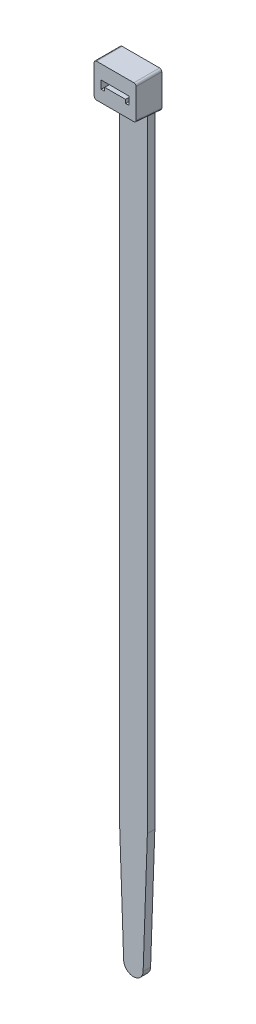
ISO-10303-21;
HEADER;
FILE_DESCRIPTION(('STEP AP214'),'2;1');
FILE_NAME('part.step','',(''),(''),'','','');
FILE_SCHEMA(('AUTOMOTIVE_DESIGN { 1 0 10303 214 1 1 1 1 }'));
ENDSEC;
DATA;
#1=APPLICATION_CONTEXT('core data for automotive mechanical design processes');
#2=APPLICATION_PROTOCOL_DEFINITION('international standard','automotive_design',2000,#1);
#3=PRODUCT_CONTEXT('',#1,'mechanical');
#4=PRODUCT('Part','Part','',(#3));
#5=PRODUCT_RELATED_PRODUCT_CATEGORY('part','',(#4));
#6=PRODUCT_DEFINITION_FORMATION('','',#4);
#7=PRODUCT_DEFINITION_CONTEXT('part definition',#1,'design');
#8=PRODUCT_DEFINITION('design','',#6,#7);
#9=PRODUCT_DEFINITION_SHAPE('','',#8);
#10=(LENGTH_UNIT() NAMED_UNIT(*) SI_UNIT(.MILLI.,.METRE.));
#11=(NAMED_UNIT(*) PLANE_ANGLE_UNIT() SI_UNIT($,.RADIAN.));
#12=(NAMED_UNIT(*) SI_UNIT($,.STERADIAN.) SOLID_ANGLE_UNIT());
#13=UNCERTAINTY_MEASURE_WITH_UNIT(LENGTH_MEASURE(1.E-05),#10,'distance_accuracy_value','');
#14=(GEOMETRIC_REPRESENTATION_CONTEXT(3) GLOBAL_UNCERTAINTY_ASSIGNED_CONTEXT((#13)) GLOBAL_UNIT_ASSIGNED_CONTEXT((#10,
#11,#12)) REPRESENTATION_CONTEXT('',''));
#15=CARTESIAN_POINT('',(0.,0.,0.));
#16=DIRECTION('',(0.,0.,1.));
#17=DIRECTION('',(1.,0.,0.));
#18=AXIS2_PLACEMENT_3D('',#15,#16,#17);
#19=CARTESIAN_POINT('',(0.,-213.244366112343,2.032));
#20=DIRECTION('',(0.,0.,-1.));
#21=DIRECTION('',(-1.,0.,0.));
#22=AXIS2_PLACEMENT_3D('',#19,#20,#21);
#23=CYLINDRICAL_SURFACE('',#22,2.65563388765673);
#24=CARTESIAN_POINT('',(0.,-213.244366112343,0.));
#25=DIRECTION('',(0.,0.,1.));
#26=DIRECTION('',(-1.,0.,0.));
#27=AXIS2_PLACEMENT_3D('',#24,#25,#26);
#28=CIRCLE('',#27,2.65563388765673);
#29=CARTESIAN_POINT('',(-2.65401614724512,-213.337046398449,0.));
#30=VERTEX_POINT('',#29);
#31=CARTESIAN_POINT('',(2.65401614724517,-213.337046398449,0.));
#32=VERTEX_POINT('',#31);
#33=EDGE_CURVE('E322',#30,#32,#28,.T.);
#34=ORIENTED_EDGE('',*,*,#33,.T.);
#35=DIRECTION('',(0.,0.,-1.));
#36=VECTOR('',#35,1.);
#37=CARTESIAN_POINT('',(2.65401614724517,-213.337046398449,2.032));
#38=LINE('',#37,#36);
#39=CARTESIAN_POINT('',(2.65401614724517,-213.337046398449,2.032));
#40=VERTEX_POINT('',#39);
#41=EDGE_CURVE('E341',#40,#32,#38,.T.);
#42=ORIENTED_EDGE('',*,*,#41,.F.);
#43=CARTESIAN_POINT('',(0.,-213.244366112343,2.032));
#44=DIRECTION('',(0.,0.,1.));
#45=DIRECTION('',(-1.,0.,0.));
#46=AXIS2_PLACEMENT_3D('',#43,#44,#45);
#47=CIRCLE('',#46,2.65563388765673);
#48=CARTESIAN_POINT('',(-2.65401614724512,-213.337046398449,2.032));
#49=VERTEX_POINT('',#48);
#50=EDGE_CURVE('E323',#49,#40,#47,.T.);
#51=ORIENTED_EDGE('',*,*,#50,.F.);
#52=DIRECTION('',(0.,0.,-1.));
#53=VECTOR('',#52,1.);
#54=CARTESIAN_POINT('',(-2.65401614724512,-213.337046398449,2.032));
#55=LINE('',#54,#53);
#56=EDGE_CURVE('E253',#49,#30,#55,.T.);
#57=ORIENTED_EDGE('',*,*,#56,.T.);
#58=EDGE_LOOP('',(#34,#42,#51,#57));
#59=FACE_BOUND('',#58,.T.);
#60=ADVANCED_FACE('F38',(#59),#23,.T.);
#61=CARTESIAN_POINT('',(3.81000000000002,-180.234,2.032));
#62=DIRECTION('',(-0.999390827019096,0.0348994967025009,0.));
#63=DIRECTION('',(-0.0348994967025009,-0.999390827019096,0.));
#64=AXIS2_PLACEMENT_3D('',#61,#62,#63);
#65=PLANE('',#64);
#66=DIRECTION('',(0.0348994967025009,0.999390827019096,0.));
#67=VECTOR('',#66,1.);
#68=CARTESIAN_POINT('',(3.81000000000002,-180.234,0.));
#69=LINE('',#68,#67);
#70=CARTESIAN_POINT('',(3.81000000000002,-180.234,0.));
#71=VERTEX_POINT('',#70);
#72=EDGE_CURVE('E333',#32,#71,#69,.T.);
#73=ORIENTED_EDGE('',*,*,#72,.T.);
#74=DIRECTION('',(0.,0.,-1.));
#75=VECTOR('',#74,1.);
#76=CARTESIAN_POINT('',(3.81000000000002,-180.234,2.032));
#77=LINE('',#76,#75);
#78=CARTESIAN_POINT('',(3.81000000000002,-180.234,2.032));
#79=VERTEX_POINT('',#78);
#80=EDGE_CURVE('E331',#79,#71,#77,.T.);
#81=ORIENTED_EDGE('',*,*,#80,.F.);
#82=DIRECTION('',(0.0348994967025009,0.999390827019096,0.));
#83=VECTOR('',#82,1.);
#84=CARTESIAN_POINT('',(3.81000000000002,-180.234,2.032));
#85=LINE('',#84,#83);
#86=EDGE_CURVE('E325',#40,#79,#85,.T.);
#87=ORIENTED_EDGE('',*,*,#86,.F.);
#88=ORIENTED_EDGE('',*,*,#41,.T.);
#89=EDGE_LOOP('',(#73,#81,#87,#88));
#90=FACE_BOUND('',#89,.T.);
#91=ADVANCED_FACE('F408',(#90),#65,.F.);
#92=CARTESIAN_POINT('',(3.81,0.,2.032));
#93=DIRECTION('',(-1.,0.,0.));
#94=DIRECTION('',(0.,-1.,0.));
#95=AXIS2_PLACEMENT_3D('',#92,#93,#94);
#96=PLANE('',#95);
#97=DIRECTION('',(0.,1.,0.));
#98=VECTOR('',#97,1.);
#99=CARTESIAN_POINT('',(3.81,0.,0.));
#100=LINE('',#99,#98);
#101=CARTESIAN_POINT('',(3.81,-9.79999999999998,0.));
#102=VERTEX_POINT('',#101);
#103=EDGE_CURVE('E335',#71,#102,#100,.T.);
#104=ORIENTED_EDGE('',*,*,#103,.T.);
#105=DIRECTION('',(0.,0.0871557427476516,0.996194698091746));
#106=VECTOR('',#105,1.);
#107=CARTESIAN_POINT('',(3.81,-9.54913144125024,2.8674407476283));
#108=LINE('',#107,#106);
#109=CARTESIAN_POINT('',(3.81,-9.62222303571533,2.032));
#110=VERTEX_POINT('',#109);
#111=EDGE_CURVE('E320',#102,#110,#108,.T.);
#112=ORIENTED_EDGE('',*,*,#111,.T.);
#113=DIRECTION('',(0.,1.,0.));
#114=VECTOR('',#113,1.);
#115=CARTESIAN_POINT('',(3.81,0.,2.032));
#116=LINE('',#115,#114);
#117=EDGE_CURVE('E328',#79,#110,#116,.T.);
#118=ORIENTED_EDGE('',*,*,#117,.F.);
#119=ORIENTED_EDGE('',*,*,#80,.T.);
#120=EDGE_LOOP('',(#104,#112,#118,#119));
#121=FACE_BOUND('',#120,.T.);
#122=ADVANCED_FACE('F406',(#121),#96,.F.);
#123=CARTESIAN_POINT('',(3.81,0.,2.032));
#124=DIRECTION('',(0.,-1.,0.));
#125=DIRECTION('',(1.,0.,0.));
#126=AXIS2_PLACEMENT_3D('',#123,#124,#125);
#127=PLANE('',#126);
#128=DIRECTION('',(-1.,0.,0.));
#129=VECTOR('',#128,1.);
#130=CARTESIAN_POINT('',(5.7,0.,7.));
#131=LINE('',#130,#129);
#132=CARTESIAN_POINT('',(5.1,0.,7.));
#133=VERTEX_POINT('',#132);
#134=CARTESIAN_POINT('',(-5.1,0.,7.));
#135=VERTEX_POINT('',#134);
#136=EDGE_CURVE('E313',#133,#135,#131,.T.);
#137=ORIENTED_EDGE('',*,*,#136,.F.);
#138=DIRECTION('',(0.,0.,-1.));
#139=VECTOR('',#138,1.);
#140=CARTESIAN_POINT('',(5.1,0.,0.));
#141=LINE('',#140,#139);
#142=CARTESIAN_POINT('',(5.1,0.,0.));
#143=VERTEX_POINT('',#142);
#144=EDGE_CURVE('E11',#133,#143,#141,.T.);
#145=ORIENTED_EDGE('',*,*,#144,.T.);
#146=DIRECTION('',(-1.,0.,0.));
#147=VECTOR('',#146,1.);
#148=CARTESIAN_POINT('',(3.81,0.,0.));
#149=LINE('',#148,#147);
#150=CARTESIAN_POINT('',(-5.1,0.,0.));
#151=VERTEX_POINT('',#150);
#152=EDGE_CURVE('E326',#143,#151,#149,.T.);
#153=ORIENTED_EDGE('',*,*,#152,.T.);
#154=DIRECTION('',(0.,0.,-1.));
#155=VECTOR('',#154,1.);
#156=CARTESIAN_POINT('',(-5.1,0.,0.));
#157=LINE('',#156,#155);
#158=EDGE_CURVE('E275',#135,#151,#157,.T.);
#159=ORIENTED_EDGE('',*,*,#158,.F.);
#160=EDGE_LOOP('',(#137,#145,#153,#159));
#161=FACE_BOUND('',#160,.T.);
#162=ADVANCED_FACE('F375',(#161),#127,.F.);
#163=CARTESIAN_POINT('',(0.,-213.244366112343,2.032));
#164=DIRECTION('',(0.,0.,-1.));
#165=DIRECTION('',(-1.,0.,0.));
#166=AXIS2_PLACEMENT_3D('',#163,#164,#165);
#167=PLANE('',#166);
#168=ORIENTED_EDGE('',*,*,#117,.T.);
#169=DIRECTION('',(-1.,0.,0.));
#170=VECTOR('',#169,1.);
#171=CARTESIAN_POINT('',(0.,-9.62222303571533,2.032));
#172=LINE('',#171,#170);
#173=CARTESIAN_POINT('',(-3.81,-9.62222303571533,2.032));
#174=VERTEX_POINT('',#173);
#175=EDGE_CURVE('E315',#110,#174,#172,.T.);
#176=ORIENTED_EDGE('',*,*,#175,.T.);
#177=DIRECTION('',(0.,1.,0.));
#178=VECTOR('',#177,1.);
#179=CARTESIAN_POINT('',(-3.81,0.,2.032));
#180=LINE('',#179,#178);
#181=CARTESIAN_POINT('',(-3.80999999999998,-180.234,2.032));
#182=VERTEX_POINT('',#181);
#183=EDGE_CURVE('E242',#182,#174,#180,.T.);
#184=ORIENTED_EDGE('',*,*,#183,.F.);
#185=DIRECTION('',(-0.0348994967025012,0.999390827019096,0.));
#186=VECTOR('',#185,1.);
#187=CARTESIAN_POINT('',(-3.80999999999998,-180.234,2.032));
#188=LINE('',#187,#186);
#189=EDGE_CURVE('E239',#49,#182,#188,.T.);
#190=ORIENTED_EDGE('',*,*,#189,.F.);
#191=ORIENTED_EDGE('',*,*,#50,.T.);
#192=ORIENTED_EDGE('',*,*,#86,.T.);
#193=EDGE_LOOP('',(#168,#176,#184,#190,#191,#192));
#194=FACE_BOUND('',#193,.T.);
#195=ADVANCED_FACE('F402',(#194),#167,.F.);
#196=CARTESIAN_POINT('',(0.,-213.244366112343,0.));
#197=DIRECTION('',(0.,0.,-1.));
#198=DIRECTION('',(-1.,0.,0.));
#199=AXIS2_PLACEMENT_3D('',#196,#197,#198);
#200=PLANE('',#199);
#201=ORIENTED_EDGE('',*,*,#33,.F.);
#202=DIRECTION('',(-0.0348994967025012,0.999390827019096,0.));
#203=VECTOR('',#202,1.);
#204=CARTESIAN_POINT('',(-3.80999999999998,-180.234,0.));
#205=LINE('',#204,#203);
#206=CARTESIAN_POINT('',(-3.80999999999998,-180.234,0.));
#207=VERTEX_POINT('',#206);
#208=EDGE_CURVE('E238',#30,#207,#205,.T.);
#209=ORIENTED_EDGE('',*,*,#208,.T.);
#210=DIRECTION('',(0.,1.,0.));
#211=VECTOR('',#210,1.);
#212=CARTESIAN_POINT('',(-3.81,0.,0.));
#213=LINE('',#212,#211);
#214=CARTESIAN_POINT('',(-3.81,-9.79999999999998,0.));
#215=VERTEX_POINT('',#214);
#216=EDGE_CURVE('E243',#207,#215,#213,.T.);
#217=ORIENTED_EDGE('',*,*,#216,.T.);
#218=DIRECTION('',(1.,0.,0.));
#219=VECTOR('',#218,1.);
#220=CARTESIAN_POINT('',(-5.7,-9.8,0.));
#221=LINE('',#220,#219);
#222=CARTESIAN_POINT('',(-5.1,-9.8,0.));
#223=VERTEX_POINT('',#222);
#224=EDGE_CURVE('E233',#223,#215,#221,.T.);
#225=ORIENTED_EDGE('',*,*,#224,.F.);
#226=CARTESIAN_POINT('',(-5.1,-9.197708097474,0.));
#227=DIRECTION('',(0.,0.,1.));
#228=DIRECTION('',(0.,1.,0.));
#229=AXIS2_PLACEMENT_3D('',#226,#227,#228);
#230=ELLIPSE('',#229,0.602291902526008,0.6);
#231=CARTESIAN_POINT('',(-5.7,-9.197708097474,0.));
#232=VERTEX_POINT('',#231);
#233=EDGE_CURVE('E272',#232,#223,#230,.T.);
#234=ORIENTED_EDGE('',*,*,#233,.F.);
#235=DIRECTION('',(0.,-1.,0.));
#236=VECTOR('',#235,1.);
#237=CARTESIAN_POINT('',(-5.7,-9.8,0.));
#238=LINE('',#237,#236);
#239=CARTESIAN_POINT('',(-5.7,-0.600000000000001,0.));
#240=VERTEX_POINT('',#239);
#241=EDGE_CURVE('E224',#240,#232,#238,.T.);
#242=ORIENTED_EDGE('',*,*,#241,.F.);
#243=CARTESIAN_POINT('',(-5.1,-0.600000000000001,0.));
#244=DIRECTION('',(0.,0.,1.));
#245=DIRECTION('',(1.,0.,0.));
#246=AXIS2_PLACEMENT_3D('',#243,#244,#245);
#247=CIRCLE('',#246,0.6);
#248=EDGE_CURVE('E269',#151,#240,#247,.T.);
#249=ORIENTED_EDGE('',*,*,#248,.F.);
#250=ORIENTED_EDGE('',*,*,#152,.F.);
#251=CARTESIAN_POINT('',(5.1,-0.6,0.));
#252=DIRECTION('',(0.,0.,-1.));
#253=DIRECTION('',(-1.,0.,0.));
#254=AXIS2_PLACEMENT_3D('',#251,#252,#253);
#255=CIRCLE('',#254,0.6);
#256=CARTESIAN_POINT('',(5.7,-0.6,0.));
#257=VERTEX_POINT('',#256);
#258=EDGE_CURVE('E53',#143,#257,#255,.T.);
#259=ORIENTED_EDGE('',*,*,#258,.T.);
#260=DIRECTION('',(0.,-1.,0.));
#261=VECTOR('',#260,1.);
#262=CARTESIAN_POINT('',(5.7,-9.8,0.));
#263=LINE('',#262,#261);
#264=CARTESIAN_POINT('',(5.7,-9.19770809747399,0.));
#265=VERTEX_POINT('',#264);
#266=EDGE_CURVE('E291',#257,#265,#263,.T.);
#267=ORIENTED_EDGE('',*,*,#266,.T.);
#268=CARTESIAN_POINT('',(5.1,-9.19770809747399,0.));
#269=DIRECTION('',(0.,0.,-1.));
#270=DIRECTION('',(0.,1.,0.));
#271=AXIS2_PLACEMENT_3D('',#268,#269,#270);
#272=ELLIPSE('',#271,0.602291902526008,0.6);
#273=CARTESIAN_POINT('',(5.1,-9.8,0.));
#274=VERTEX_POINT('',#273);
#275=EDGE_CURVE('E46',#265,#274,#272,.T.);
#276=ORIENTED_EDGE('',*,*,#275,.T.);
#277=DIRECTION('',(-1.,0.,0.));
#278=VECTOR('',#277,1.);
#279=CARTESIAN_POINT('',(5.7,-9.8,0.));
#280=LINE('',#279,#278);
#281=EDGE_CURVE('E312',#274,#102,#280,.T.);
#282=ORIENTED_EDGE('',*,*,#281,.T.);
#283=ORIENTED_EDGE('',*,*,#103,.F.);
#284=ORIENTED_EDGE('',*,*,#72,.F.);
#285=EDGE_LOOP('',(#201,#209,#217,#225,#234,#242,#249,#250,#259,#267,#276,#282,#283,#284));
#286=FACE_BOUND('',#285,.T.);
#287=DIRECTION('',(0.,-1.,0.));
#288=VECTOR('',#287,1.);
#289=CARTESIAN_POINT('',(-2.85,-6.,0.));
#290=LINE('',#289,#288);
#291=CARTESIAN_POINT('',(-2.85,-5.05,0.));
#292=VERTEX_POINT('',#291);
#293=CARTESIAN_POINT('',(-2.85,-6.,0.));
#294=VERTEX_POINT('',#293);
#295=EDGE_CURVE('E205',#292,#294,#290,.T.);
#296=ORIENTED_EDGE('',*,*,#295,.F.);
#297=DIRECTION('',(1.,0.,0.));
#298=VECTOR('',#297,1.);
#299=CARTESIAN_POINT('',(2.85,-5.05,0.));
#300=LINE('',#299,#298);
#301=CARTESIAN_POINT('',(2.85,-5.05,0.));
#302=VERTEX_POINT('',#301);
#303=EDGE_CURVE('E190',#292,#302,#300,.T.);
#304=ORIENTED_EDGE('',*,*,#303,.T.);
#305=DIRECTION('',(0.,-1.,0.));
#306=VECTOR('',#305,1.);
#307=CARTESIAN_POINT('',(2.85,-6.,0.));
#308=LINE('',#307,#306);
#309=CARTESIAN_POINT('',(2.85,-6.,0.));
#310=VERTEX_POINT('',#309);
#311=EDGE_CURVE('E301',#302,#310,#308,.T.);
#312=ORIENTED_EDGE('',*,*,#311,.T.);
#313=DIRECTION('',(1.,0.,0.));
#314=VECTOR('',#313,1.);
#315=CARTESIAN_POINT('',(3.8,-6.,0.));
#316=LINE('',#315,#314);
#317=CARTESIAN_POINT('',(3.8,-6.,0.));
#318=VERTEX_POINT('',#317);
#319=EDGE_CURVE('E297',#310,#318,#316,.T.);
#320=ORIENTED_EDGE('',*,*,#319,.T.);
#321=DIRECTION('',(0.,1.,0.));
#322=VECTOR('',#321,1.);
#323=CARTESIAN_POINT('',(3.8,-3.8,0.));
#324=LINE('',#323,#322);
#325=CARTESIAN_POINT('',(3.8,-3.8,0.));
#326=VERTEX_POINT('',#325);
#327=EDGE_CURVE('E293',#318,#326,#324,.T.);
#328=ORIENTED_EDGE('',*,*,#327,.T.);
#329=DIRECTION('',(-1.,0.,0.));
#330=VECTOR('',#329,1.);
#331=CARTESIAN_POINT('',(0.,-3.8,0.));
#332=LINE('',#331,#330);
#333=CARTESIAN_POINT('',(-3.8,-3.8,0.));
#334=VERTEX_POINT('',#333);
#335=EDGE_CURVE('E289',#326,#334,#332,.T.);
#336=ORIENTED_EDGE('',*,*,#335,.T.);
#337=DIRECTION('',(0.,1.,0.));
#338=VECTOR('',#337,1.);
#339=CARTESIAN_POINT('',(-3.8,-3.8,0.));
#340=LINE('',#339,#338);
#341=CARTESIAN_POINT('',(-3.8,-6.,0.));
#342=VERTEX_POINT('',#341);
#343=EDGE_CURVE('E225',#342,#334,#340,.T.);
#344=ORIENTED_EDGE('',*,*,#343,.F.);
#345=DIRECTION('',(-1.,0.,0.));
#346=VECTOR('',#345,1.);
#347=CARTESIAN_POINT('',(-3.8,-6.,0.));
#348=LINE('',#347,#346);
#349=EDGE_CURVE('E214',#294,#342,#348,.T.);
#350=ORIENTED_EDGE('',*,*,#349,.F.);
#351=EDGE_LOOP('',(#296,#304,#312,#320,#328,#336,#344,#350));
#352=FACE_BOUND('',#351,.T.);
#353=ADVANCED_FACE('F211',(#286,#352),#200,.T.);
#354=CARTESIAN_POINT('',(5.7,-9.18757935531858,7.));
#355=DIRECTION('',(0.,-0.996194698091746,0.0871557427476516));
#356=DIRECTION('',(0.,-0.0871557427476516,-0.996194698091746));
#357=AXIS2_PLACEMENT_3D('',#354,#355,#356);
#358=PLANE('',#357);
#359=ORIENTED_EDGE('',*,*,#281,.F.);
#360=DIRECTION('',(0.,0.0871557427476516,0.996194698091746));
#361=VECTOR('',#360,1.);
#362=CARTESIAN_POINT('',(5.1,-9.18757935531858,7.));
#363=LINE('',#362,#361);
#364=CARTESIAN_POINT('',(5.1,-9.18757935531858,7.));
#365=VERTEX_POINT('',#364);
#366=EDGE_CURVE('E344',#274,#365,#363,.T.);
#367=ORIENTED_EDGE('',*,*,#366,.T.);
#368=DIRECTION('',(-1.,0.,0.));
#369=VECTOR('',#368,1.);
#370=CARTESIAN_POINT('',(5.7,-9.18757935531858,7.));
#371=LINE('',#370,#369);
#372=CARTESIAN_POINT('',(-5.1,-9.18757935531858,7.));
#373=VERTEX_POINT('',#372);
#374=EDGE_CURVE('E316',#365,#373,#371,.T.);
#375=ORIENTED_EDGE('',*,*,#374,.T.);
#376=DIRECTION('',(0.,0.0871557427476516,0.996194698091746));
#377=VECTOR('',#376,1.);
#378=CARTESIAN_POINT('',(-5.1,-9.18757935531858,7.));
#379=LINE('',#378,#377);
#380=EDGE_CURVE('E256',#223,#373,#379,.T.);
#381=ORIENTED_EDGE('',*,*,#380,.F.);
#382=ORIENTED_EDGE('',*,*,#224,.T.);
#383=DIRECTION('',(0.,0.0871557427476516,0.996194698091746));
#384=VECTOR('',#383,1.);
#385=CARTESIAN_POINT('',(-3.81,-9.54913144125025,2.8674407476283));
#386=LINE('',#385,#384);
#387=EDGE_CURVE('E235',#215,#174,#386,.T.);
#388=ORIENTED_EDGE('',*,*,#387,.T.);
#389=ORIENTED_EDGE('',*,*,#175,.F.);
#390=ORIENTED_EDGE('',*,*,#111,.F.);
#391=EDGE_LOOP('',(#359,#367,#375,#381,#382,#388,#389,#390));
#392=FACE_BOUND('',#391,.T.);
#393=ADVANCED_FACE('F362',(#392),#358,.T.);
#394=CARTESIAN_POINT('',(5.7,0.,7.));
#395=DIRECTION('',(0.,0.,1.));
#396=DIRECTION('',(0.,-1.,0.));
#397=AXIS2_PLACEMENT_3D('',#394,#395,#396);
#398=PLANE('',#397);
#399=DIRECTION('',(1.,0.,0.));
#400=VECTOR('',#399,1.);
#401=CARTESIAN_POINT('',(2.85,-5.05,7.));
#402=LINE('',#401,#400);
#403=CARTESIAN_POINT('',(-2.85,-5.05,7.));
#404=VERTEX_POINT('',#403);
#405=CARTESIAN_POINT('',(2.85,-5.05,7.));
#406=VERTEX_POINT('',#405);
#407=EDGE_CURVE('E278',#404,#406,#402,.T.);
#408=ORIENTED_EDGE('',*,*,#407,.F.);
#409=DIRECTION('',(0.,-1.,0.));
#410=VECTOR('',#409,1.);
#411=CARTESIAN_POINT('',(-2.85,-6.,7.));
#412=LINE('',#411,#410);
#413=CARTESIAN_POINT('',(-2.85,-6.,7.));
#414=VERTEX_POINT('',#413);
#415=EDGE_CURVE('E208',#404,#414,#412,.T.);
#416=ORIENTED_EDGE('',*,*,#415,.T.);
#417=DIRECTION('',(-1.,0.,0.));
#418=VECTOR('',#417,1.);
#419=CARTESIAN_POINT('',(-3.8,-6.,7.));
#420=LINE('',#419,#418);
#421=CARTESIAN_POINT('',(-3.8,-6.,7.));
#422=VERTEX_POINT('',#421);
#423=EDGE_CURVE('E652',#414,#422,#420,.T.);
#424=ORIENTED_EDGE('',*,*,#423,.T.);
#425=DIRECTION('',(0.,1.,0.));
#426=VECTOR('',#425,1.);
#427=CARTESIAN_POINT('',(-3.8,-3.8,7.));
#428=LINE('',#427,#426);
#429=CARTESIAN_POINT('',(-3.8,-3.8,7.));
#430=VERTEX_POINT('',#429);
#431=EDGE_CURVE('E209',#422,#430,#428,.T.);
#432=ORIENTED_EDGE('',*,*,#431,.T.);
#433=DIRECTION('',(-1.,0.,0.));
#434=VECTOR('',#433,1.);
#435=CARTESIAN_POINT('',(0.,-3.8,7.));
#436=LINE('',#435,#434);
#437=CARTESIAN_POINT('',(3.8,-3.8,7.));
#438=VERTEX_POINT('',#437);
#439=EDGE_CURVE('E200',#438,#430,#436,.T.);
#440=ORIENTED_EDGE('',*,*,#439,.F.);
#441=DIRECTION('',(0.,1.,0.));
#442=VECTOR('',#441,1.);
#443=CARTESIAN_POINT('',(3.8,-3.8,7.));
#444=LINE('',#443,#442);
#445=CARTESIAN_POINT('',(3.8,-6.,7.));
#446=VERTEX_POINT('',#445);
#447=EDGE_CURVE('E280',#446,#438,#444,.T.);
#448=ORIENTED_EDGE('',*,*,#447,.F.);
#449=DIRECTION('',(1.,0.,0.));
#450=VECTOR('',#449,1.);
#451=CARTESIAN_POINT('',(3.8,-6.,7.));
#452=LINE('',#451,#450);
#453=CARTESIAN_POINT('',(2.85,-6.,7.));
#454=VERTEX_POINT('',#453);
#455=EDGE_CURVE('E282',#454,#446,#452,.T.);
#456=ORIENTED_EDGE('',*,*,#455,.F.);
#457=DIRECTION('',(0.,-1.,0.));
#458=VECTOR('',#457,1.);
#459=CARTESIAN_POINT('',(2.85,-6.,7.));
#460=LINE('',#459,#458);
#461=EDGE_CURVE('E285',#406,#454,#460,.T.);
#462=ORIENTED_EDGE('',*,*,#461,.F.);
#463=EDGE_LOOP('',(#408,#416,#424,#432,#440,#448,#456,#462));
#464=FACE_BOUND('',#463,.T.);
#465=ORIENTED_EDGE('',*,*,#374,.F.);
#466=CARTESIAN_POINT('',(5.1,-8.58528745279257,7.));
#467=DIRECTION('',(0.,0.,1.));
#468=DIRECTION('',(0.,1.,0.));
#469=AXIS2_PLACEMENT_3D('',#466,#467,#468);
#470=ELLIPSE('',#469,0.602291902526008,0.6);
#471=CARTESIAN_POINT('',(5.7,-8.58528745279257,7.));
#472=VERTEX_POINT('',#471);
#473=EDGE_CURVE('E349',#365,#472,#470,.T.);
#474=ORIENTED_EDGE('',*,*,#473,.T.);
#475=DIRECTION('',(0.,1.,0.));
#476=VECTOR('',#475,1.);
#477=CARTESIAN_POINT('',(5.7,0.,7.));
#478=LINE('',#477,#476);
#479=CARTESIAN_POINT('',(5.7,-0.6,7.));
#480=VERTEX_POINT('',#479);
#481=EDGE_CURVE('E309',#472,#480,#478,.T.);
#482=ORIENTED_EDGE('',*,*,#481,.T.);
#483=CARTESIAN_POINT('',(5.1,-0.6,7.));
#484=DIRECTION('',(0.,0.,1.));
#485=DIRECTION('',(0.,-1.,0.));
#486=AXIS2_PLACEMENT_3D('',#483,#484,#485);
#487=CIRCLE('',#486,0.6);
#488=EDGE_CURVE('E347',#480,#133,#487,.T.);
#489=ORIENTED_EDGE('',*,*,#488,.T.);
#490=ORIENTED_EDGE('',*,*,#136,.T.);
#491=CARTESIAN_POINT('',(-5.1,-0.600000000000001,7.));
#492=DIRECTION('',(0.,0.,-1.));
#493=DIRECTION('',(0.,-1.,0.));
#494=AXIS2_PLACEMENT_3D('',#491,#492,#493);
#495=CIRCLE('',#494,0.6);
#496=CARTESIAN_POINT('',(-5.7,-0.600000000000002,7.));
#497=VERTEX_POINT('',#496);
#498=EDGE_CURVE('E259',#497,#135,#495,.T.);
#499=ORIENTED_EDGE('',*,*,#498,.F.);
#500=DIRECTION('',(0.,1.,0.));
#501=VECTOR('',#500,1.);
#502=CARTESIAN_POINT('',(-5.7,0.,7.));
#503=LINE('',#502,#501);
#504=CARTESIAN_POINT('',(-5.7,-8.58528745279257,7.));
#505=VERTEX_POINT('',#504);
#506=EDGE_CURVE('E230',#505,#497,#503,.T.);
#507=ORIENTED_EDGE('',*,*,#506,.F.);
#508=CARTESIAN_POINT('',(-5.1,-8.58528745279257,7.));
#509=DIRECTION('',(0.,0.,-1.));
#510=DIRECTION('',(0.,1.,0.));
#511=AXIS2_PLACEMENT_3D('',#508,#509,#510);
#512=ELLIPSE('',#511,0.602291902526008,0.6);
#513=EDGE_CURVE('E262',#373,#505,#512,.T.);
#514=ORIENTED_EDGE('',*,*,#513,.F.);
#515=EDGE_LOOP('',(#465,#474,#482,#489,#490,#499,#507,#514));
#516=FACE_BOUND('',#515,.T.);
#517=ADVANCED_FACE('F367',(#464,#516),#398,.T.);
#518=CARTESIAN_POINT('',(5.7,0.,0.));
#519=DIRECTION('',(1.,0.,0.));
#520=DIRECTION('',(0.,1.,0.));
#521=AXIS2_PLACEMENT_3D('',#518,#519,#520);
#522=PLANE('',#521);
#523=ORIENTED_EDGE('',*,*,#481,.F.);
#524=DIRECTION('',(0.,0.0871557427476516,0.996194698091746));
#525=VECTOR('',#524,1.);
#526=CARTESIAN_POINT('',(5.7,-9.12784117090478,0.798582624919305));
#527=LINE('',#526,#525);
#528=EDGE_CURVE('E60',#472,#265,#527,.F.);
#529=ORIENTED_EDGE('',*,*,#528,.T.);
#530=ORIENTED_EDGE('',*,*,#266,.F.);
#531=DIRECTION('',(0.,0.,-1.));
#532=VECTOR('',#531,1.);
#533=CARTESIAN_POINT('',(5.7,-0.6,7.));
#534=LINE('',#533,#532);
#535=EDGE_CURVE('E351',#257,#480,#534,.F.);
#536=ORIENTED_EDGE('',*,*,#535,.T.);
#537=EDGE_LOOP('',(#523,#529,#530,#536));
#538=FACE_BOUND('',#537,.T.);
#539=ADVANCED_FACE('F370',(#538),#522,.T.);
#540=CARTESIAN_POINT('',(2.85,-5.05,-4.39089968002003));
#541=DIRECTION('',(0.,-1.,0.));
#542=DIRECTION('',(0.,0.,-1.));
#543=AXIS2_PLACEMENT_3D('',#540,#541,#542);
#544=PLANE('',#543);
#545=ORIENTED_EDGE('',*,*,#303,.F.);
#546=DIRECTION('',(0.,0.,1.));
#547=VECTOR('',#546,1.);
#548=CARTESIAN_POINT('',(-2.85,-5.05,-4.39089968002003));
#549=LINE('',#548,#547);
#550=EDGE_CURVE('E194',#292,#404,#549,.T.);
#551=ORIENTED_EDGE('',*,*,#550,.T.);
#552=ORIENTED_EDGE('',*,*,#407,.T.);
#553=DIRECTION('',(0.,0.,1.));
#554=VECTOR('',#553,1.);
#555=CARTESIAN_POINT('',(2.85,-5.05,-4.39089968002003));
#556=LINE('',#555,#554);
#557=EDGE_CURVE('E196',#302,#406,#556,.T.);
#558=ORIENTED_EDGE('',*,*,#557,.F.);
#559=EDGE_LOOP('',(#545,#551,#552,#558));
#560=FACE_BOUND('',#559,.T.);
#561=ADVANCED_FACE('F192',(#560),#544,.F.);
#562=CARTESIAN_POINT('',(2.85,-6.,-4.39089968002003));
#563=DIRECTION('',(-1.,0.,0.));
#564=DIRECTION('',(0.,0.,1.));
#565=AXIS2_PLACEMENT_3D('',#562,#563,#564);
#566=PLANE('',#565);
#567=ORIENTED_EDGE('',*,*,#557,.T.);
#568=ORIENTED_EDGE('',*,*,#461,.T.);
#569=DIRECTION('',(0.,0.,1.));
#570=VECTOR('',#569,1.);
#571=CARTESIAN_POINT('',(2.85,-6.,-4.39089968002003));
#572=LINE('',#571,#570);
#573=EDGE_CURVE('E300',#310,#454,#572,.T.);
#574=ORIENTED_EDGE('',*,*,#573,.F.);
#575=ORIENTED_EDGE('',*,*,#311,.F.);
#576=EDGE_LOOP('',(#567,#568,#574,#575));
#577=FACE_BOUND('',#576,.T.);
#578=ADVANCED_FACE('F438',(#577),#566,.F.);
#579=CARTESIAN_POINT('',(3.8,-6.,-4.39089968002003));
#580=DIRECTION('',(0.,-1.,0.));
#581=DIRECTION('',(0.,0.,-1.));
#582=AXIS2_PLACEMENT_3D('',#579,#580,#581);
#583=PLANE('',#582);
#584=ORIENTED_EDGE('',*,*,#573,.T.);
#585=ORIENTED_EDGE('',*,*,#455,.T.);
#586=DIRECTION('',(0.,0.,1.));
#587=VECTOR('',#586,1.);
#588=CARTESIAN_POINT('',(3.8,-6.,-4.39089968002003));
#589=LINE('',#588,#587);
#590=EDGE_CURVE('E296',#318,#446,#589,.T.);
#591=ORIENTED_EDGE('',*,*,#590,.F.);
#592=ORIENTED_EDGE('',*,*,#319,.F.);
#593=EDGE_LOOP('',(#584,#585,#591,#592));
#594=FACE_BOUND('',#593,.T.);
#595=ADVANCED_FACE('F430',(#594),#583,.F.);
#596=CARTESIAN_POINT('',(3.8,-3.8,-4.39089968002003));
#597=DIRECTION('',(1.,0.,0.));
#598=DIRECTION('',(0.,1.,0.));
#599=AXIS2_PLACEMENT_3D('',#596,#597,#598);
#600=PLANE('',#599);
#601=ORIENTED_EDGE('',*,*,#590,.T.);
#602=ORIENTED_EDGE('',*,*,#447,.T.);
#603=DIRECTION('',(0.,0.,1.));
#604=VECTOR('',#603,1.);
#605=CARTESIAN_POINT('',(3.8,-3.8,-4.39089968002003));
#606=LINE('',#605,#604);
#607=EDGE_CURVE('E292',#326,#438,#606,.T.);
#608=ORIENTED_EDGE('',*,*,#607,.F.);
#609=ORIENTED_EDGE('',*,*,#327,.F.);
#610=EDGE_LOOP('',(#601,#602,#608,#609));
#611=FACE_BOUND('',#610,.T.);
#612=ADVANCED_FACE('F424',(#611),#600,.F.);
#613=CARTESIAN_POINT('',(0.,-3.8,-4.39089968002003));
#614=DIRECTION('',(0.,1.,0.));
#615=DIRECTION('',(0.,0.,1.));
#616=AXIS2_PLACEMENT_3D('',#613,#614,#615);
#617=PLANE('',#616);
#618=ORIENTED_EDGE('',*,*,#607,.T.);
#619=ORIENTED_EDGE('',*,*,#439,.T.);
#620=DIRECTION('',(0.,0.,1.));
#621=VECTOR('',#620,1.);
#622=CARTESIAN_POINT('',(-3.8,-3.8,-4.39089968002003));
#623=LINE('',#622,#621);
#624=EDGE_CURVE('E221',#334,#430,#623,.T.);
#625=ORIENTED_EDGE('',*,*,#624,.F.);
#626=ORIENTED_EDGE('',*,*,#335,.F.);
#627=EDGE_LOOP('',(#618,#619,#625,#626));
#628=FACE_BOUND('',#627,.T.);
#629=ADVANCED_FACE('F419',(#628),#617,.F.);
#630=CARTESIAN_POINT('',(5.1,-8.58986253646353,6.94770655435141));
#631=DIRECTION('',(0.,0.0871557427476516,0.996194698091746));
#632=DIRECTION('',(0.,-0.996194698091746,0.0871557427476516));
#633=AXIS2_PLACEMENT_3D('',#630,#631,#632);
#634=CYLINDRICAL_SURFACE('',#633,0.6);
#635=ORIENTED_EDGE('',*,*,#275,.F.);
#636=ORIENTED_EDGE('',*,*,#528,.F.);
#637=ORIENTED_EDGE('',*,*,#473,.F.);
#638=ORIENTED_EDGE('',*,*,#366,.F.);
#639=EDGE_LOOP('',(#635,#636,#637,#638));
#640=FACE_BOUND('',#639,.T.);
#641=ADVANCED_FACE('F365',(#640),#634,.T.);
#642=CARTESIAN_POINT('',(5.1,-0.6,2.032));
#643=DIRECTION('',(0.,0.,1.));
#644=DIRECTION('',(1.,0.,0.));
#645=AXIS2_PLACEMENT_3D('',#642,#643,#644);
#646=CYLINDRICAL_SURFACE('',#645,0.6);
#647=ORIENTED_EDGE('',*,*,#488,.F.);
#648=ORIENTED_EDGE('',*,*,#535,.F.);
#649=ORIENTED_EDGE('',*,*,#258,.F.);
#650=ORIENTED_EDGE('',*,*,#144,.F.);
#651=EDGE_LOOP('',(#647,#648,#649,#650));
#652=FACE_BOUND('',#651,.T.);
#653=ADVANCED_FACE('F40',(#652),#646,.T.);
#654=CARTESIAN_POINT('',(-3.80999999999998,-180.234,2.032));
#655=DIRECTION('',(0.999390827019096,0.0348994967025012,0.));
#656=DIRECTION('',(0.0348994967025012,-0.999390827019096,0.));
#657=AXIS2_PLACEMENT_3D('',#654,#655,#656);
#658=PLANE('',#657);
#659=ORIENTED_EDGE('',*,*,#208,.F.);
#660=ORIENTED_EDGE('',*,*,#56,.F.);
#661=ORIENTED_EDGE('',*,*,#189,.T.);
#662=DIRECTION('',(0.,0.,-1.));
#663=VECTOR('',#662,1.);
#664=CARTESIAN_POINT('',(-3.80999999999998,-180.234,2.032));
#665=LINE('',#664,#663);
#666=EDGE_CURVE('E246',#182,#207,#665,.T.);
#667=ORIENTED_EDGE('',*,*,#666,.T.);
#668=EDGE_LOOP('',(#659,#660,#661,#667));
#669=FACE_BOUND('',#668,.T.);
#670=ADVANCED_FACE('F396',(#669),#658,.F.);
#671=CARTESIAN_POINT('',(-3.81,0.,2.032));
#672=DIRECTION('',(1.,0.,0.));
#673=DIRECTION('',(0.,-1.,0.));
#674=AXIS2_PLACEMENT_3D('',#671,#672,#673);
#675=PLANE('',#674);
#676=ORIENTED_EDGE('',*,*,#216,.F.);
#677=ORIENTED_EDGE('',*,*,#666,.F.);
#678=ORIENTED_EDGE('',*,*,#183,.T.);
#679=ORIENTED_EDGE('',*,*,#387,.F.);
#680=EDGE_LOOP('',(#676,#677,#678,#679));
#681=FACE_BOUND('',#680,.T.);
#682=ADVANCED_FACE('F390',(#681),#675,.F.);
#683=CARTESIAN_POINT('',(-5.7,0.,0.));
#684=DIRECTION('',(-1.,0.,0.));
#685=DIRECTION('',(0.,1.,0.));
#686=AXIS2_PLACEMENT_3D('',#683,#684,#685);
#687=PLANE('',#686);
#688=ORIENTED_EDGE('',*,*,#506,.T.);
#689=DIRECTION('',(0.,0.,-1.));
#690=VECTOR('',#689,1.);
#691=CARTESIAN_POINT('',(-5.7,-0.600000000000002,7.));
#692=LINE('',#691,#690);
#693=EDGE_CURVE('E265',#240,#497,#692,.F.);
#694=ORIENTED_EDGE('',*,*,#693,.F.);
#695=ORIENTED_EDGE('',*,*,#241,.T.);
#696=DIRECTION('',(0.,0.0871557427476516,0.996194698091746));
#697=VECTOR('',#696,1.);
#698=CARTESIAN_POINT('',(-5.7,-9.12784117090479,0.798582624919305));
#699=LINE('',#698,#697);
#700=EDGE_CURVE('E267',#505,#232,#699,.F.);
#701=ORIENTED_EDGE('',*,*,#700,.F.);
#702=EDGE_LOOP('',(#688,#694,#695,#701));
#703=FACE_BOUND('',#702,.T.);
#704=ADVANCED_FACE('F383',(#703),#687,.T.);
#705=CARTESIAN_POINT('',(-2.85,-6.,-4.39089968002003));
#706=DIRECTION('',(1.,0.,0.));
#707=DIRECTION('',(0.,0.,1.));
#708=AXIS2_PLACEMENT_3D('',#705,#706,#707);
#709=PLANE('',#708);
#710=ORIENTED_EDGE('',*,*,#550,.F.);
#711=ORIENTED_EDGE('',*,*,#295,.T.);
#712=DIRECTION('',(0.,0.,1.));
#713=VECTOR('',#712,1.);
#714=CARTESIAN_POINT('',(-2.85,-6.,-4.39089968002003));
#715=LINE('',#714,#713);
#716=EDGE_CURVE('E215',#294,#414,#715,.T.);
#717=ORIENTED_EDGE('',*,*,#716,.T.);
#718=ORIENTED_EDGE('',*,*,#415,.F.);
#719=EDGE_LOOP('',(#710,#711,#717,#718));
#720=FACE_BOUND('',#719,.T.);
#721=ADVANCED_FACE('F204',(#720),#709,.F.);
#722=CARTESIAN_POINT('',(-3.8,-6.,-4.39089968002003));
#723=DIRECTION('',(0.,-1.,0.));
#724=DIRECTION('',(0.,0.,-1.));
#725=AXIS2_PLACEMENT_3D('',#722,#723,#724);
#726=PLANE('',#725);
#727=ORIENTED_EDGE('',*,*,#716,.F.);
#728=ORIENTED_EDGE('',*,*,#349,.T.);
#729=DIRECTION('',(0.,0.,1.));
#730=VECTOR('',#729,1.);
#731=CARTESIAN_POINT('',(-3.8,-6.,-4.39089968002003));
#732=LINE('',#731,#730);
#733=EDGE_CURVE('E226',#342,#422,#732,.T.);
#734=ORIENTED_EDGE('',*,*,#733,.T.);
#735=ORIENTED_EDGE('',*,*,#423,.F.);
#736=EDGE_LOOP('',(#727,#728,#734,#735));
#737=FACE_BOUND('',#736,.T.);
#738=ADVANCED_FACE('F604',(#737),#726,.F.);
#739=CARTESIAN_POINT('',(-3.8,-3.8,-4.39089968002003));
#740=DIRECTION('',(-1.,0.,0.));
#741=DIRECTION('',(0.,1.,0.));
#742=AXIS2_PLACEMENT_3D('',#739,#740,#741);
#743=PLANE('',#742);
#744=ORIENTED_EDGE('',*,*,#733,.F.);
#745=ORIENTED_EDGE('',*,*,#343,.T.);
#746=ORIENTED_EDGE('',*,*,#624,.T.);
#747=ORIENTED_EDGE('',*,*,#431,.F.);
#748=EDGE_LOOP('',(#744,#745,#746,#747));
#749=FACE_BOUND('',#748,.T.);
#750=ADVANCED_FACE('F612',(#749),#743,.F.);
#751=CARTESIAN_POINT('',(-5.1,-8.58986253646353,6.94770655435141));
#752=DIRECTION('',(0.,0.0871557427476516,0.996194698091746));
#753=DIRECTION('',(0.,-0.996194698091746,0.0871557427476516));
#754=AXIS2_PLACEMENT_3D('',#751,#752,#753);
#755=CYLINDRICAL_SURFACE('',#754,0.6);
#756=ORIENTED_EDGE('',*,*,#233,.T.);
#757=ORIENTED_EDGE('',*,*,#380,.T.);
#758=ORIENTED_EDGE('',*,*,#513,.T.);
#759=ORIENTED_EDGE('',*,*,#700,.T.);
#760=EDGE_LOOP('',(#756,#757,#758,#759));
#761=FACE_BOUND('',#760,.T.);
#762=ADVANCED_FACE('F386',(#761),#755,.T.);
#763=CARTESIAN_POINT('',(-5.1,-0.600000000000001,2.032));
#764=DIRECTION('',(0.,0.,1.));
#765=DIRECTION('',(-1.,0.,0.));
#766=AXIS2_PLACEMENT_3D('',#763,#764,#765);
#767=CYLINDRICAL_SURFACE('',#766,0.6);
#768=ORIENTED_EDGE('',*,*,#498,.T.);
#769=ORIENTED_EDGE('',*,*,#158,.T.);
#770=ORIENTED_EDGE('',*,*,#248,.T.);
#771=ORIENTED_EDGE('',*,*,#693,.T.);
#772=EDGE_LOOP('',(#768,#769,#770,#771));
#773=FACE_BOUND('',#772,.T.);
#774=ADVANCED_FACE('F379',(#773),#767,.T.);
#775=CLOSED_SHELL('',(#60,#91,#122,#162,#195,#353,#393,#517,#539,#561,#578,#595,#612,#629,#641,
#653,#670,#682,#704,#721,#738,#750,#762,#774));
#776=MANIFOLD_SOLID_BREP('B2',#775);
#777=ADVANCED_BREP_SHAPE_REPRESENTATION('',(#18,#776),#14);
#778=SHAPE_DEFINITION_REPRESENTATION(#9,#777);
ENDSEC;
END-ISO-10303-21;
